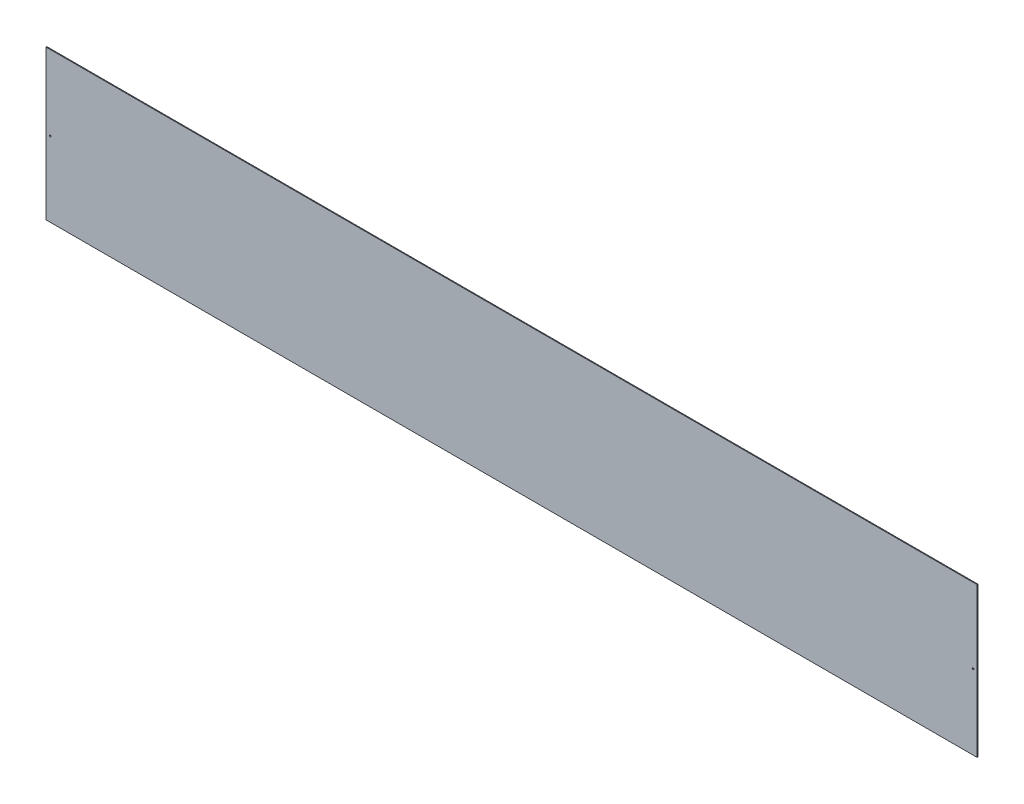
ISO-10303-21;
HEADER;
FILE_DESCRIPTION(('STEP AP214'),'2;1');
FILE_NAME('part.step','',(''),(''),'','','');
FILE_SCHEMA(('AUTOMOTIVE_DESIGN { 1 0 10303 214 1 1 1 1 }'));
ENDSEC;
DATA;
#1=APPLICATION_CONTEXT('core data for automotive mechanical design processes');
#2=APPLICATION_PROTOCOL_DEFINITION('international standard','automotive_design',2000,#1);
#3=PRODUCT_CONTEXT('',#1,'mechanical');
#4=PRODUCT('Part','Part','',(#3));
#5=PRODUCT_RELATED_PRODUCT_CATEGORY('part','',(#4));
#6=PRODUCT_DEFINITION_FORMATION('','',#4);
#7=PRODUCT_DEFINITION_CONTEXT('part definition',#1,'design');
#8=PRODUCT_DEFINITION('design','',#6,#7);
#9=PRODUCT_DEFINITION_SHAPE('','',#8);
#10=(LENGTH_UNIT() NAMED_UNIT(*) SI_UNIT(.MILLI.,.METRE.));
#11=(NAMED_UNIT(*) PLANE_ANGLE_UNIT() SI_UNIT($,.RADIAN.));
#12=(NAMED_UNIT(*) SI_UNIT($,.STERADIAN.) SOLID_ANGLE_UNIT());
#13=UNCERTAINTY_MEASURE_WITH_UNIT(LENGTH_MEASURE(1.E-05),#10,'distance_accuracy_value','');
#14=(GEOMETRIC_REPRESENTATION_CONTEXT(3) GLOBAL_UNCERTAINTY_ASSIGNED_CONTEXT((#13)) GLOBAL_UNIT_ASSIGNED_CONTEXT((#10,
#11,#12)) REPRESENTATION_CONTEXT('',''));
#15=CARTESIAN_POINT('',(0.,0.,0.));
#16=DIRECTION('',(0.,0.,1.));
#17=DIRECTION('',(1.,0.,0.));
#18=AXIS2_PLACEMENT_3D('',#15,#16,#17);
#19=CARTESIAN_POINT('',(560.,-90.,1.));
#20=DIRECTION('',(-1.,0.,0.));
#21=DIRECTION('',(0.,0.,1.));
#22=AXIS2_PLACEMENT_3D('',#19,#20,#21);
#23=PLANE('',#22);
#24=DIRECTION('',(0.,1.,0.));
#25=VECTOR('',#24,1.);
#26=CARTESIAN_POINT('',(560.,-90.,0.));
#27=LINE('',#26,#25);
#28=CARTESIAN_POINT('',(560.,-90.,0.));
#29=VERTEX_POINT('',#28);
#30=CARTESIAN_POINT('',(560.,90.,0.));
#31=VERTEX_POINT('',#30);
#32=EDGE_CURVE('E107',#29,#31,#27,.T.);
#33=ORIENTED_EDGE('',*,*,#32,.T.);
#34=DIRECTION('',(0.,0.,-1.));
#35=VECTOR('',#34,1.);
#36=CARTESIAN_POINT('',(560.,90.,1.));
#37=LINE('',#36,#35);
#38=CARTESIAN_POINT('',(560.,90.,1.));
#39=VERTEX_POINT('',#38);
#40=EDGE_CURVE('E11',#39,#31,#37,.T.);
#41=ORIENTED_EDGE('',*,*,#40,.F.);
#42=DIRECTION('',(0.,1.,0.));
#43=VECTOR('',#42,1.);
#44=CARTESIAN_POINT('',(560.,-90.,1.));
#45=LINE('',#44,#43);
#46=CARTESIAN_POINT('',(560.,-90.,1.));
#47=VERTEX_POINT('',#46);
#48=EDGE_CURVE('E91',#47,#39,#45,.T.);
#49=ORIENTED_EDGE('',*,*,#48,.F.);
#50=DIRECTION('',(0.,0.,-1.));
#51=VECTOR('',#50,1.);
#52=CARTESIAN_POINT('',(560.,-90.,1.));
#53=LINE('',#52,#51);
#54=EDGE_CURVE('E103',#47,#29,#53,.T.);
#55=ORIENTED_EDGE('',*,*,#54,.T.);
#56=EDGE_LOOP('',(#33,#41,#49,#55));
#57=FACE_BOUND('',#56,.T.);
#58=ADVANCED_FACE('F39',(#57),#23,.F.);
#59=CARTESIAN_POINT('',(-560.,90.,1.));
#60=DIRECTION('',(0.,-1.,0.));
#61=DIRECTION('',(0.,0.,-1.));
#62=AXIS2_PLACEMENT_3D('',#59,#60,#61);
#63=PLANE('',#62);
#64=DIRECTION('',(-1.,0.,0.));
#65=VECTOR('',#64,1.);
#66=CARTESIAN_POINT('',(-560.,90.,0.));
#67=LINE('',#66,#65);
#68=CARTESIAN_POINT('',(-560.,90.,0.));
#69=VERTEX_POINT('',#68);
#70=EDGE_CURVE('E96',#31,#69,#67,.T.);
#71=ORIENTED_EDGE('',*,*,#70,.T.);
#72=DIRECTION('',(0.,0.,-1.));
#73=VECTOR('',#72,1.);
#74=CARTESIAN_POINT('',(-560.,90.,1.));
#75=LINE('',#74,#73);
#76=CARTESIAN_POINT('',(-560.,90.,1.));
#77=VERTEX_POINT('',#76);
#78=EDGE_CURVE('E48',#77,#69,#75,.T.);
#79=ORIENTED_EDGE('',*,*,#78,.F.);
#80=DIRECTION('',(-1.,0.,0.));
#81=VECTOR('',#80,1.);
#82=CARTESIAN_POINT('',(-560.,90.,1.));
#83=LINE('',#82,#81);
#84=EDGE_CURVE('E86',#39,#77,#83,.T.);
#85=ORIENTED_EDGE('',*,*,#84,.F.);
#86=ORIENTED_EDGE('',*,*,#40,.T.);
#87=EDGE_LOOP('',(#71,#79,#85,#86));
#88=FACE_BOUND('',#87,.T.);
#89=ADVANCED_FACE('F95',(#88),#63,.F.);
#90=CARTESIAN_POINT('',(-560.,-90.,1.));
#91=DIRECTION('',(1.,0.,0.));
#92=DIRECTION('',(0.,0.,-1.));
#93=AXIS2_PLACEMENT_3D('',#90,#91,#92);
#94=PLANE('',#93);
#95=DIRECTION('',(0.,-1.,0.));
#96=VECTOR('',#95,1.);
#97=CARTESIAN_POINT('',(-560.,-90.,0.));
#98=LINE('',#97,#96);
#99=CARTESIAN_POINT('',(-560.,-90.,0.));
#100=VERTEX_POINT('',#99);
#101=EDGE_CURVE('E73',#69,#100,#98,.T.);
#102=ORIENTED_EDGE('',*,*,#101,.T.);
#103=DIRECTION('',(0.,0.,-1.));
#104=VECTOR('',#103,1.);
#105=CARTESIAN_POINT('',(-560.,-90.,1.));
#106=LINE('',#105,#104);
#107=CARTESIAN_POINT('',(-560.,-90.,1.));
#108=VERTEX_POINT('',#107);
#109=EDGE_CURVE('E98',#108,#100,#106,.T.);
#110=ORIENTED_EDGE('',*,*,#109,.F.);
#111=DIRECTION('',(0.,-1.,0.));
#112=VECTOR('',#111,1.);
#113=CARTESIAN_POINT('',(-560.,-90.,1.));
#114=LINE('',#113,#112);
#115=EDGE_CURVE('E89',#77,#108,#114,.T.);
#116=ORIENTED_EDGE('',*,*,#115,.F.);
#117=ORIENTED_EDGE('',*,*,#78,.T.);
#118=EDGE_LOOP('',(#102,#110,#116,#117));
#119=FACE_BOUND('',#118,.T.);
#120=ADVANCED_FACE('F99',(#119),#94,.F.);
#121=CARTESIAN_POINT('',(-560.,-90.,1.));
#122=DIRECTION('',(0.,1.,0.));
#123=DIRECTION('',(0.,0.,1.));
#124=AXIS2_PLACEMENT_3D('',#121,#122,#123);
#125=PLANE('',#124);
#126=DIRECTION('',(1.,0.,0.));
#127=VECTOR('',#126,1.);
#128=CARTESIAN_POINT('',(-560.,-90.,0.));
#129=LINE('',#128,#127);
#130=EDGE_CURVE('E79',#100,#29,#129,.T.);
#131=ORIENTED_EDGE('',*,*,#130,.T.);
#132=ORIENTED_EDGE('',*,*,#54,.F.);
#133=DIRECTION('',(1.,0.,0.));
#134=VECTOR('',#133,1.);
#135=CARTESIAN_POINT('',(-560.,-90.,1.));
#136=LINE('',#135,#134);
#137=EDGE_CURVE('E56',#108,#47,#136,.T.);
#138=ORIENTED_EDGE('',*,*,#137,.F.);
#139=ORIENTED_EDGE('',*,*,#109,.T.);
#140=EDGE_LOOP('',(#131,#132,#138,#139));
#141=FACE_BOUND('',#140,.T.);
#142=ADVANCED_FACE('F121',(#141),#125,.F.);
#143=CARTESIAN_POINT('',(0.,0.,1.));
#144=DIRECTION('',(0.,0.,-1.));
#145=DIRECTION('',(-1.,0.,0.));
#146=AXIS2_PLACEMENT_3D('',#143,#144,#145);
#147=PLANE('',#146);
#148=CARTESIAN_POINT('',(-555.,0.,1.));
#149=DIRECTION('',(0.,0.,1.));
#150=DIRECTION('',(1.,0.,0.));
#151=AXIS2_PLACEMENT_3D('',#148,#149,#150);
#152=CIRCLE('',#151,1.00000000000005);
#153=CARTESIAN_POINT('',(-554.,0.,1.));
#154=VERTEX_POINT('',#153);
#155=EDGE_CURVE('E132',#154,#154,#152,.T.);
#156=ORIENTED_EDGE('',*,*,#155,.F.);
#157=EDGE_LOOP('',(#156));
#158=FACE_BOUND('',#157,.T.);
#159=CARTESIAN_POINT('',(555.,0.,1.));
#160=DIRECTION('',(0.,0.,-1.));
#161=DIRECTION('',(-1.,0.,0.));
#162=AXIS2_PLACEMENT_3D('',#159,#160,#161);
#163=CIRCLE('',#162,1.00000000000005);
#164=CARTESIAN_POINT('',(554.,0.,1.));
#165=VERTEX_POINT('',#164);
#166=EDGE_CURVE('E111',#165,#165,#163,.T.);
#167=ORIENTED_EDGE('',*,*,#166,.T.);
#168=EDGE_LOOP('',(#167));
#169=FACE_BOUND('',#168,.T.);
#170=ORIENTED_EDGE('',*,*,#48,.T.);
#171=ORIENTED_EDGE('',*,*,#84,.T.);
#172=ORIENTED_EDGE('',*,*,#115,.T.);
#173=ORIENTED_EDGE('',*,*,#137,.T.);
#174=EDGE_LOOP('',(#170,#171,#172,#173));
#175=FACE_BOUND('',#174,.T.);
#176=ADVANCED_FACE('F87',(#158,#169,#175),#147,.F.);
#177=CARTESIAN_POINT('',(0.,0.,0.));
#178=DIRECTION('',(0.,0.,-1.));
#179=DIRECTION('',(-1.,0.,0.));
#180=AXIS2_PLACEMENT_3D('',#177,#178,#179);
#181=PLANE('',#180);
#182=CARTESIAN_POINT('',(-555.,0.,0.));
#183=DIRECTION('',(0.,0.,1.));
#184=DIRECTION('',(1.,0.,0.));
#185=AXIS2_PLACEMENT_3D('',#182,#183,#184);
#186=CIRCLE('',#185,1.00000000000005);
#187=CARTESIAN_POINT('',(-554.,0.,0.));
#188=VERTEX_POINT('',#187);
#189=EDGE_CURVE('E136',#188,#188,#186,.T.);
#190=ORIENTED_EDGE('',*,*,#189,.T.);
#191=EDGE_LOOP('',(#190));
#192=FACE_BOUND('',#191,.T.);
#193=CARTESIAN_POINT('',(555.,0.,0.));
#194=DIRECTION('',(0.,0.,-1.));
#195=DIRECTION('',(-1.,0.,0.));
#196=AXIS2_PLACEMENT_3D('',#193,#194,#195);
#197=CIRCLE('',#196,1.00000000000005);
#198=CARTESIAN_POINT('',(554.,0.,0.));
#199=VERTEX_POINT('',#198);
#200=EDGE_CURVE('E128',#199,#199,#197,.T.);
#201=ORIENTED_EDGE('',*,*,#200,.F.);
#202=EDGE_LOOP('',(#201));
#203=FACE_BOUND('',#202,.T.);
#204=ORIENTED_EDGE('',*,*,#32,.F.);
#205=ORIENTED_EDGE('',*,*,#130,.F.);
#206=ORIENTED_EDGE('',*,*,#101,.F.);
#207=ORIENTED_EDGE('',*,*,#70,.F.);
#208=EDGE_LOOP('',(#204,#205,#206,#207));
#209=FACE_BOUND('',#208,.T.);
#210=ADVANCED_FACE('F124',(#192,#203,#209),#181,.T.);
#211=CARTESIAN_POINT('',(555.,0.,1.));
#212=DIRECTION('',(0.,0.,-1.));
#213=DIRECTION('',(-1.,0.,0.));
#214=AXIS2_PLACEMENT_3D('',#211,#212,#213);
#215=CYLINDRICAL_SURFACE('',#214,1.00000000000005);
#216=ORIENTED_EDGE('',*,*,#166,.F.);
#217=EDGE_LOOP('',(#216));
#218=FACE_BOUND('',#217,.T.);
#219=ORIENTED_EDGE('',*,*,#200,.T.);
#220=EDGE_LOOP('',(#219));
#221=FACE_BOUND('',#220,.T.);
#222=ADVANCED_FACE('F152',(#218,#221),#215,.F.);
#223=CARTESIAN_POINT('',(-555.,0.,1.));
#224=DIRECTION('',(0.,0.,-1.));
#225=DIRECTION('',(-1.,0.,0.));
#226=AXIS2_PLACEMENT_3D('',#223,#224,#225);
#227=CYLINDRICAL_SURFACE('',#226,1.00000000000005);
#228=ORIENTED_EDGE('',*,*,#155,.T.);
#229=EDGE_LOOP('',(#228));
#230=FACE_BOUND('',#229,.T.);
#231=ORIENTED_EDGE('',*,*,#189,.F.);
#232=EDGE_LOOP('',(#231));
#233=FACE_BOUND('',#232,.T.);
#234=ADVANCED_FACE('F144',(#230,#233),#227,.F.);
#235=CLOSED_SHELL('',(#58,#89,#120,#142,#176,#210,#222,#234));
#236=MANIFOLD_SOLID_BREP('B2',#235);
#237=ADVANCED_BREP_SHAPE_REPRESENTATION('',(#18,#236),#14);
#238=SHAPE_DEFINITION_REPRESENTATION(#9,#237);
ENDSEC;
END-ISO-10303-21;
